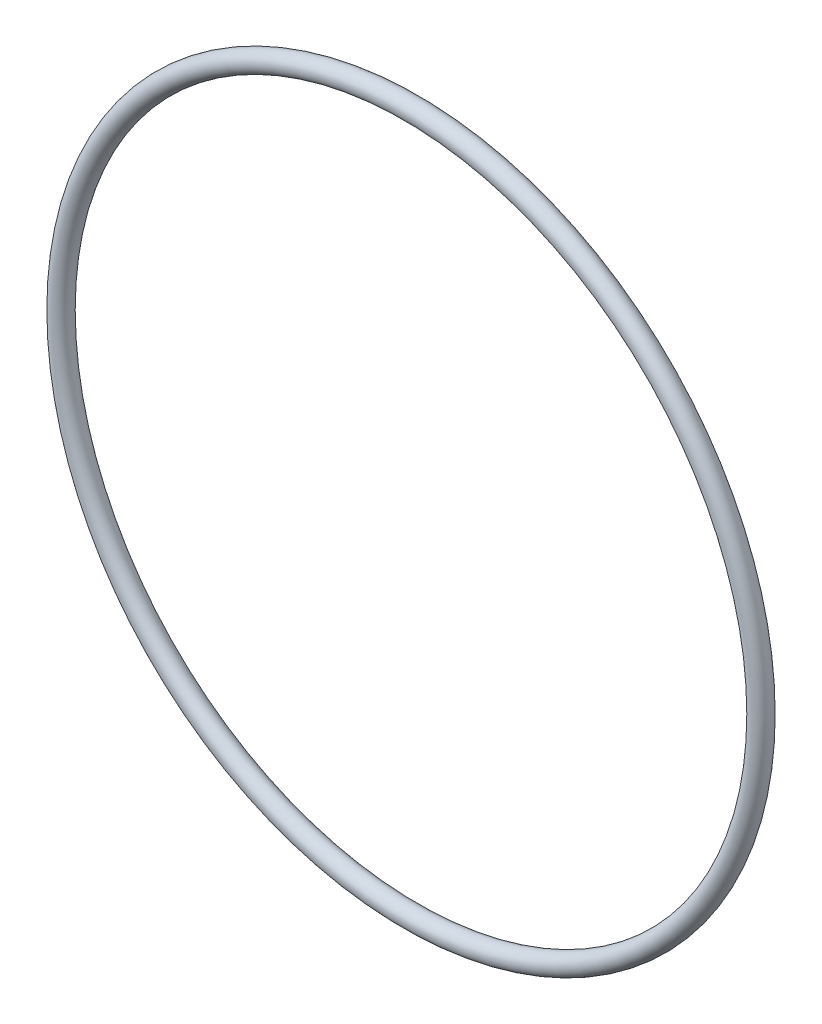
ISO-10303-21;
HEADER;
FILE_DESCRIPTION(('STEP AP214'),'2;1');
FILE_NAME('part.step','',(''),(''),'','','');
FILE_SCHEMA(('AUTOMOTIVE_DESIGN { 1 0 10303 214 1 1 1 1 }'));
ENDSEC;
DATA;
#1=APPLICATION_CONTEXT('core data for automotive mechanical design processes');
#2=APPLICATION_PROTOCOL_DEFINITION('international standard','automotive_design',2000,#1);
#3=PRODUCT_CONTEXT('',#1,'mechanical');
#4=PRODUCT('Part','Part','',(#3));
#5=PRODUCT_RELATED_PRODUCT_CATEGORY('part','',(#4));
#6=PRODUCT_DEFINITION_FORMATION('','',#4);
#7=PRODUCT_DEFINITION_CONTEXT('part definition',#1,'design');
#8=PRODUCT_DEFINITION('design','',#6,#7);
#9=PRODUCT_DEFINITION_SHAPE('','',#8);
#10=(LENGTH_UNIT() NAMED_UNIT(*) SI_UNIT(.MILLI.,.METRE.));
#11=(NAMED_UNIT(*) PLANE_ANGLE_UNIT() SI_UNIT($,.RADIAN.));
#12=(NAMED_UNIT(*) SI_UNIT($,.STERADIAN.) SOLID_ANGLE_UNIT());
#13=UNCERTAINTY_MEASURE_WITH_UNIT(LENGTH_MEASURE(1.E-05),#10,'distance_accuracy_value','');
#14=(GEOMETRIC_REPRESENTATION_CONTEXT(3) GLOBAL_UNCERTAINTY_ASSIGNED_CONTEXT((#13)) GLOBAL_UNIT_ASSIGNED_CONTEXT((#10,
#11,#12)) REPRESENTATION_CONTEXT('',''));
#15=CARTESIAN_POINT('',(0.,0.,0.));
#16=DIRECTION('',(0.,0.,1.));
#17=DIRECTION('',(1.,0.,0.));
#18=AXIS2_PLACEMENT_3D('',#15,#16,#17);
#19=CARTESIAN_POINT('',(0.,0.,0.));
#20=DIRECTION('',(0.,0.,1.));
#21=DIRECTION('',(1.,0.,0.));
#22=AXIS2_PLACEMENT_3D('',#19,#20,#21);
#23=TOROIDAL_SURFACE('',#22,45.593,1.3081);
#24=CARTESIAN_POINT('',(46.9011,0.,0.));
#25=VERTEX_POINT('',#24);
#26=VERTEX_LOOP('',#25);
#27=FACE_BOUND('',#26,.T.);
#28=ADVANCED_FACE('F30',(#27),#23,.T.);
#29=CLOSED_SHELL('',(#28));
#30=MANIFOLD_SOLID_BREP('B2',#29);
#31=ADVANCED_BREP_SHAPE_REPRESENTATION('',(#18,#30),#14);
#32=SHAPE_DEFINITION_REPRESENTATION(#9,#31);
ENDSEC;
END-ISO-10303-21;
